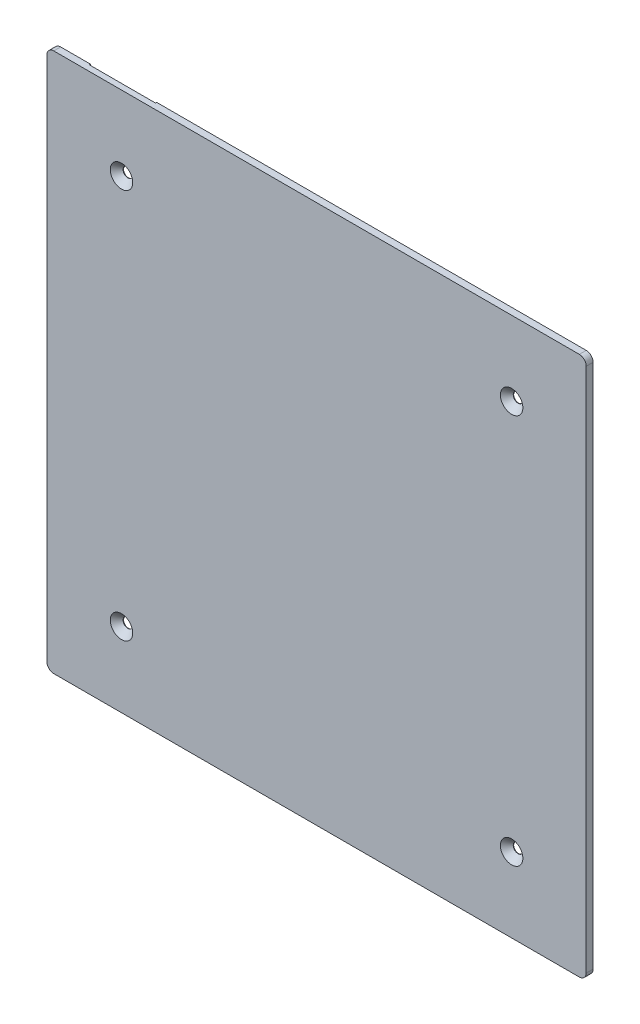
ISO-10303-21;
HEADER;
FILE_DESCRIPTION(('STEP AP214'),'2;1');
FILE_NAME('part.step','',(''),(''),'','','');
FILE_SCHEMA(('AUTOMOTIVE_DESIGN { 1 0 10303 214 1 1 1 1 }'));
ENDSEC;
DATA;
#1=APPLICATION_CONTEXT('core data for automotive mechanical design processes');
#2=APPLICATION_PROTOCOL_DEFINITION('international standard','automotive_design',2000,#1);
#3=PRODUCT_CONTEXT('',#1,'mechanical');
#4=PRODUCT('Part','Part','',(#3));
#5=PRODUCT_RELATED_PRODUCT_CATEGORY('part','',(#4));
#6=PRODUCT_DEFINITION_FORMATION('','',#4);
#7=PRODUCT_DEFINITION_CONTEXT('part definition',#1,'design');
#8=PRODUCT_DEFINITION('design','',#6,#7);
#9=PRODUCT_DEFINITION_SHAPE('','',#8);
#10=(LENGTH_UNIT() NAMED_UNIT(*) SI_UNIT(.MILLI.,.METRE.));
#11=(NAMED_UNIT(*) PLANE_ANGLE_UNIT() SI_UNIT($,.RADIAN.));
#12=(NAMED_UNIT(*) SI_UNIT($,.STERADIAN.) SOLID_ANGLE_UNIT());
#13=UNCERTAINTY_MEASURE_WITH_UNIT(LENGTH_MEASURE(1.E-05),#10,'distance_accuracy_value','');
#14=(GEOMETRIC_REPRESENTATION_CONTEXT(3) GLOBAL_UNCERTAINTY_ASSIGNED_CONTEXT((#13)) GLOBAL_UNIT_ASSIGNED_CONTEXT((#10,
#11,#12)) REPRESENTATION_CONTEXT('',''));
#15=CARTESIAN_POINT('',(0.,0.,0.));
#16=DIRECTION('',(0.,0.,1.));
#17=DIRECTION('',(1.,0.,0.));
#18=AXIS2_PLACEMENT_3D('',#15,#16,#17);
#19=CARTESIAN_POINT('',(-72.6507614869108,117.5,0.5));
#20=DIRECTION('',(1.,0.,0.));
#21=DIRECTION('',(0.,0.,-1.));
#22=AXIS2_PLACEMENT_3D('',#19,#20,#21);
#23=PLANE('',#22);
#24=DIRECTION('',(0.,0.,-1.));
#25=VECTOR('',#24,1.);
#26=CARTESIAN_POINT('',(-72.6507614869108,106.050790199477,0.5));
#27=LINE('',#26,#25);
#28=CARTESIAN_POINT('',(-72.6507614869108,106.050790199477,0.));
#29=VERTEX_POINT('',#28);
#30=CARTESIAN_POINT('',(-72.6507614869108,106.050790199477,0.5));
#31=VERTEX_POINT('',#30);
#32=EDGE_CURVE('E169',#29,#31,#27,.F.);
#33=ORIENTED_EDGE('',*,*,#32,.T.);
#34=DIRECTION('',(0.,1.,0.));
#35=VECTOR('',#34,1.);
#36=CARTESIAN_POINT('',(-72.6507614869108,0.,0.5));
#37=LINE('',#36,#35);
#38=CARTESIAN_POINT('',(-72.6507614869108,117.5,0.5));
#39=VERTEX_POINT('',#38);
#40=EDGE_CURVE('E116',#39,#31,#37,.F.);
#41=ORIENTED_EDGE('',*,*,#40,.F.);
#42=DIRECTION('',(0.,0.,-1.));
#43=VECTOR('',#42,1.);
#44=CARTESIAN_POINT('',(-72.6507614869108,117.5,0.5));
#45=LINE('',#44,#43);
#46=CARTESIAN_POINT('',(-72.6507614869108,117.5,0.));
#47=VERTEX_POINT('',#46);
#48=EDGE_CURVE('E112',#47,#39,#45,.F.);
#49=ORIENTED_EDGE('',*,*,#48,.F.);
#50=DIRECTION('',(0.,1.,0.));
#51=VECTOR('',#50,1.);
#52=CARTESIAN_POINT('',(-72.6507614869108,0.,0.));
#53=LINE('',#52,#51);
#54=EDGE_CURVE('E115',#29,#47,#53,.T.);
#55=ORIENTED_EDGE('',*,*,#54,.F.);
#56=EDGE_LOOP('',(#33,#41,#49,#55));
#57=FACE_BOUND('',#56,.T.);
#58=ADVANCED_FACE('F16',(#57),#23,.F.);
#59=CARTESIAN_POINT('',(-101.46292574176,117.5,0.5));
#60=DIRECTION('',(-1.,0.,0.));
#61=DIRECTION('',(0.,0.,1.));
#62=AXIS2_PLACEMENT_3D('',#59,#60,#61);
#63=PLANE('',#62);
#64=DIRECTION('',(0.,0.,1.));
#65=VECTOR('',#64,1.);
#66=CARTESIAN_POINT('',(-101.46292574176,117.5,0.5));
#67=LINE('',#66,#65);
#68=CARTESIAN_POINT('',(-101.46292574176,117.5,0.5));
#69=VERTEX_POINT('',#68);
#70=CARTESIAN_POINT('',(-101.46292574176,117.5,0.));
#71=VERTEX_POINT('',#70);
#72=EDGE_CURVE('E121',#69,#71,#67,.F.);
#73=ORIENTED_EDGE('',*,*,#72,.F.);
#74=DIRECTION('',(0.,1.,0.));
#75=VECTOR('',#74,1.);
#76=CARTESIAN_POINT('',(-101.46292574176,0.,0.5));
#77=LINE('',#76,#75);
#78=CARTESIAN_POINT('',(-101.46292574176,106.050790199477,0.5));
#79=VERTEX_POINT('',#78);
#80=EDGE_CURVE('E129',#79,#69,#77,.T.);
#81=ORIENTED_EDGE('',*,*,#80,.F.);
#82=DIRECTION('',(0.,0.,-1.));
#83=VECTOR('',#82,1.);
#84=CARTESIAN_POINT('',(-101.46292574176,106.050790199477,0.5));
#85=LINE('',#84,#83);
#86=CARTESIAN_POINT('',(-101.46292574176,106.050790199477,0.));
#87=VERTEX_POINT('',#86);
#88=EDGE_CURVE('E172',#79,#87,#85,.T.);
#89=ORIENTED_EDGE('',*,*,#88,.T.);
#90=DIRECTION('',(0.,1.,0.));
#91=VECTOR('',#90,1.);
#92=CARTESIAN_POINT('',(-101.46292574176,0.,0.));
#93=LINE('',#92,#91);
#94=EDGE_CURVE('E93',#71,#87,#93,.F.);
#95=ORIENTED_EDGE('',*,*,#94,.F.);
#96=EDGE_LOOP('',(#73,#81,#89,#95));
#97=FACE_BOUND('',#96,.T.);
#98=ADVANCED_FACE('F336',(#97),#63,.F.);
#99=CARTESIAN_POINT('',(-72.6507614869108,106.050790199477,0.5));
#100=DIRECTION('',(0.,-1.,0.));
#101=DIRECTION('',(0.,0.,-1.));
#102=AXIS2_PLACEMENT_3D('',#99,#100,#101);
#103=PLANE('',#102);
#104=ORIENTED_EDGE('',*,*,#88,.F.);
#105=DIRECTION('',(-1.,0.,0.));
#106=VECTOR('',#105,1.);
#107=CARTESIAN_POINT('',(0.,106.050790199477,0.5));
#108=LINE('',#107,#106);
#109=EDGE_CURVE('E184',#31,#79,#108,.T.);
#110=ORIENTED_EDGE('',*,*,#109,.F.);
#111=ORIENTED_EDGE('',*,*,#32,.F.);
#112=DIRECTION('',(-1.,0.,0.));
#113=VECTOR('',#112,1.);
#114=CARTESIAN_POINT('',(0.,106.050790199477,0.));
#115=LINE('',#114,#113);
#116=EDGE_CURVE('E128',#87,#29,#115,.F.);
#117=ORIENTED_EDGE('',*,*,#116,.F.);
#118=EDGE_LOOP('',(#104,#110,#111,#117));
#119=FACE_BOUND('',#118,.T.);
#120=ADVANCED_FACE('F249',(#119),#103,.F.);
#121=CARTESIAN_POINT('',(-85.,-85.,3.));
#122=DIRECTION('',(0.,0.,-1.));
#123=DIRECTION('',(-1.,0.,0.));
#124=AXIS2_PLACEMENT_3D('',#121,#122,#123);
#125=CYLINDRICAL_SURFACE('',#124,2.1);
#126=CARTESIAN_POINT('',(-85.,-85.,0.));
#127=DIRECTION('',(0.,0.,-1.));
#128=DIRECTION('',(-1.,0.,0.));
#129=AXIS2_PLACEMENT_3D('',#126,#127,#128);
#130=CIRCLE('',#129,2.1);
#131=CARTESIAN_POINT('',(-87.1,-85.,0.));
#132=VERTEX_POINT('',#131);
#133=EDGE_CURVE('E19',#132,#132,#130,.F.);
#134=ORIENTED_EDGE('',*,*,#133,.F.);
#135=EDGE_LOOP('',(#134));
#136=FACE_BOUND('',#135,.T.);
#137=CARTESIAN_POINT('',(-85.,-85.,0.200000000006639));
#138=DIRECTION('',(0.,0.,1.));
#139=DIRECTION('',(1.,0.,0.));
#140=AXIS2_PLACEMENT_3D('',#137,#138,#139);
#141=CIRCLE('',#140,2.09999999994806);
#142=CARTESIAN_POINT('',(-82.9000000000519,-85.,0.200000000006639));
#143=VERTEX_POINT('',#142);
#144=EDGE_CURVE('E164',#143,#143,#141,.T.);
#145=ORIENTED_EDGE('',*,*,#144,.T.);
#146=EDGE_LOOP('',(#145));
#147=FACE_BOUND('',#146,.T.);
#148=ADVANCED_FACE('F245',(#136,#147),#125,.F.);
#149=CARTESIAN_POINT('',(85.,-85.,3.));
#150=DIRECTION('',(0.,0.,-1.));
#151=DIRECTION('',(-1.,0.,0.));
#152=AXIS2_PLACEMENT_3D('',#149,#150,#151);
#153=CYLINDRICAL_SURFACE('',#152,2.1);
#154=CARTESIAN_POINT('',(85.,-85.,0.));
#155=DIRECTION('',(0.,0.,-1.));
#156=DIRECTION('',(-1.,0.,0.));
#157=AXIS2_PLACEMENT_3D('',#154,#155,#156);
#158=CIRCLE('',#157,2.1);
#159=CARTESIAN_POINT('',(82.9,-85.,0.));
#160=VERTEX_POINT('',#159);
#161=EDGE_CURVE('E167',#160,#160,#158,.F.);
#162=ORIENTED_EDGE('',*,*,#161,.F.);
#163=EDGE_LOOP('',(#162));
#164=FACE_BOUND('',#163,.T.);
#165=CARTESIAN_POINT('',(85.,-85.,0.200000000006639));
#166=DIRECTION('',(0.,0.,1.));
#167=DIRECTION('',(1.,0.,0.));
#168=AXIS2_PLACEMENT_3D('',#165,#166,#167);
#169=CIRCLE('',#168,2.09999999996396);
#170=CARTESIAN_POINT('',(87.099999999964,-85.,0.200000000006639));
#171=VERTEX_POINT('',#170);
#172=EDGE_CURVE('E161',#171,#171,#169,.T.);
#173=ORIENTED_EDGE('',*,*,#172,.T.);
#174=EDGE_LOOP('',(#173));
#175=FACE_BOUND('',#174,.T.);
#176=ADVANCED_FACE('F248',(#164,#175),#153,.F.);
#177=CARTESIAN_POINT('',(85.,85.,3.));
#178=DIRECTION('',(0.,0.,-1.));
#179=DIRECTION('',(-1.,0.,0.));
#180=AXIS2_PLACEMENT_3D('',#177,#178,#179);
#181=CYLINDRICAL_SURFACE('',#180,2.1);
#182=CARTESIAN_POINT('',(85.,85.,0.));
#183=DIRECTION('',(0.,0.,-1.));
#184=DIRECTION('',(-1.,0.,0.));
#185=AXIS2_PLACEMENT_3D('',#182,#183,#184);
#186=CIRCLE('',#185,2.1);
#187=CARTESIAN_POINT('',(82.9,85.,0.));
#188=VERTEX_POINT('',#187);
#189=EDGE_CURVE('E235',#188,#188,#186,.F.);
#190=ORIENTED_EDGE('',*,*,#189,.F.);
#191=EDGE_LOOP('',(#190));
#192=FACE_BOUND('',#191,.T.);
#193=CARTESIAN_POINT('',(85.,85.,0.200000000006639));
#194=DIRECTION('',(0.,0.,1.));
#195=DIRECTION('',(1.,0.,0.));
#196=AXIS2_PLACEMENT_3D('',#193,#194,#195);
#197=CIRCLE('',#196,2.09999999996396);
#198=CARTESIAN_POINT('',(87.099999999964,85.,0.200000000006639));
#199=VERTEX_POINT('',#198);
#200=EDGE_CURVE('E158',#199,#199,#197,.T.);
#201=ORIENTED_EDGE('',*,*,#200,.T.);
#202=EDGE_LOOP('',(#201));
#203=FACE_BOUND('',#202,.T.);
#204=ADVANCED_FACE('F319',(#192,#203),#181,.F.);
#205=CARTESIAN_POINT('',(-85.,85.,3.));
#206=DIRECTION('',(0.,0.,-1.));
#207=DIRECTION('',(-1.,0.,0.));
#208=AXIS2_PLACEMENT_3D('',#205,#206,#207);
#209=CYLINDRICAL_SURFACE('',#208,2.1);
#210=CARTESIAN_POINT('',(-85.,85.,0.));
#211=DIRECTION('',(0.,0.,-1.));
#212=DIRECTION('',(-1.,0.,0.));
#213=AXIS2_PLACEMENT_3D('',#210,#211,#212);
#214=CIRCLE('',#213,2.1);
#215=CARTESIAN_POINT('',(-87.1,85.,0.));
#216=VERTEX_POINT('',#215);
#217=EDGE_CURVE('E237',#216,#216,#214,.F.);
#218=ORIENTED_EDGE('',*,*,#217,.F.);
#219=EDGE_LOOP('',(#218));
#220=FACE_BOUND('',#219,.T.);
#221=CARTESIAN_POINT('',(-85.,85.,0.200000000006639));
#222=DIRECTION('',(0.,0.,1.));
#223=DIRECTION('',(1.,0.,0.));
#224=AXIS2_PLACEMENT_3D('',#221,#222,#223);
#225=CIRCLE('',#224,2.09999999994806);
#226=CARTESIAN_POINT('',(-82.9000000000519,85.,0.200000000006639));
#227=VERTEX_POINT('',#226);
#228=EDGE_CURVE('E155',#227,#227,#225,.T.);
#229=ORIENTED_EDGE('',*,*,#228,.T.);
#230=EDGE_LOOP('',(#229));
#231=FACE_BOUND('',#230,.T.);
#232=ADVANCED_FACE('F321',(#220,#231),#209,.F.);
#233=CARTESIAN_POINT('',(0.,0.,0.5));
#234=DIRECTION('',(0.,0.,-1.));
#235=DIRECTION('',(-1.,0.,0.));
#236=AXIS2_PLACEMENT_3D('',#233,#234,#235);
#237=PLANE('',#236);
#238=ORIENTED_EDGE('',*,*,#80,.T.);
#239=DIRECTION('',(1.,0.,0.));
#240=VECTOR('',#239,1.);
#241=CARTESIAN_POINT('',(-117.5,117.5,0.5));
#242=LINE('',#241,#240);
#243=EDGE_CURVE('E135',#69,#39,#242,.T.);
#244=ORIENTED_EDGE('',*,*,#243,.T.);
#245=ORIENTED_EDGE('',*,*,#40,.T.);
#246=ORIENTED_EDGE('',*,*,#109,.T.);
#247=EDGE_LOOP('',(#238,#244,#245,#246));
#248=FACE_BOUND('',#247,.T.);
#249=ADVANCED_FACE('F266',(#248),#237,.T.);
#250=CARTESIAN_POINT('',(0.,0.,0.));
#251=DIRECTION('',(0.,0.,-1.));
#252=DIRECTION('',(-1.,0.,0.));
#253=AXIS2_PLACEMENT_3D('',#250,#251,#252);
#254=PLANE('',#253);
#255=ORIENTED_EDGE('',*,*,#161,.T.);
#256=EDGE_LOOP('',(#255));
#257=FACE_BOUND('',#256,.T.);
#258=ORIENTED_EDGE('',*,*,#189,.T.);
#259=EDGE_LOOP('',(#258));
#260=FACE_BOUND('',#259,.T.);
#261=ORIENTED_EDGE('',*,*,#217,.T.);
#262=EDGE_LOOP('',(#261));
#263=FACE_BOUND('',#262,.T.);
#264=ORIENTED_EDGE('',*,*,#133,.T.);
#265=EDGE_LOOP('',(#264));
#266=FACE_BOUND('',#265,.T.);
#267=ORIENTED_EDGE('',*,*,#94,.T.);
#268=ORIENTED_EDGE('',*,*,#116,.T.);
#269=ORIENTED_EDGE('',*,*,#54,.T.);
#270=DIRECTION('',(1.,0.,0.));
#271=VECTOR('',#270,1.);
#272=CARTESIAN_POINT('',(-117.5,117.5,0.));
#273=LINE('',#272,#271);
#274=CARTESIAN_POINT('',(114.5,117.5,0.));
#275=VERTEX_POINT('',#274);
#276=EDGE_CURVE('E125',#47,#275,#273,.T.);
#277=ORIENTED_EDGE('',*,*,#276,.T.);
#278=CARTESIAN_POINT('',(114.5,114.5,0.));
#279=DIRECTION('',(0.,0.,-1.));
#280=DIRECTION('',(-1.,0.,0.));
#281=AXIS2_PLACEMENT_3D('',#278,#279,#280);
#282=CIRCLE('',#281,3.);
#283=CARTESIAN_POINT('',(117.5,114.5,0.));
#284=VERTEX_POINT('',#283);
#285=EDGE_CURVE('E134',#284,#275,#282,.F.);
#286=ORIENTED_EDGE('',*,*,#285,.F.);
#287=DIRECTION('',(0.,1.,0.));
#288=VECTOR('',#287,1.);
#289=CARTESIAN_POINT('',(117.5,-117.5,0.));
#290=LINE('',#289,#288);
#291=CARTESIAN_POINT('',(117.5,-114.5,0.));
#292=VERTEX_POINT('',#291);
#293=EDGE_CURVE('E142',#284,#292,#290,.F.);
#294=ORIENTED_EDGE('',*,*,#293,.T.);
#295=CARTESIAN_POINT('',(114.5,-114.5,0.));
#296=DIRECTION('',(0.,0.,-1.));
#297=DIRECTION('',(-1.,0.,0.));
#298=AXIS2_PLACEMENT_3D('',#295,#296,#297);
#299=CIRCLE('',#298,3.);
#300=CARTESIAN_POINT('',(114.5,-117.5,0.));
#301=VERTEX_POINT('',#300);
#302=EDGE_CURVE('E229',#301,#292,#299,.F.);
#303=ORIENTED_EDGE('',*,*,#302,.F.);
#304=DIRECTION('',(1.,0.,0.));
#305=VECTOR('',#304,1.);
#306=CARTESIAN_POINT('',(-117.5,-117.5,0.));
#307=LINE('',#306,#305);
#308=CARTESIAN_POINT('',(-114.5,-117.5,0.));
#309=VERTEX_POINT('',#308);
#310=EDGE_CURVE('E228',#301,#309,#307,.F.);
#311=ORIENTED_EDGE('',*,*,#310,.T.);
#312=CARTESIAN_POINT('',(-114.5,-114.5,0.));
#313=DIRECTION('',(0.,0.,-1.));
#314=DIRECTION('',(-1.,0.,0.));
#315=AXIS2_PLACEMENT_3D('',#312,#313,#314);
#316=CIRCLE('',#315,3.);
#317=CARTESIAN_POINT('',(-117.5,-114.5,0.));
#318=VERTEX_POINT('',#317);
#319=EDGE_CURVE('E225',#318,#309,#316,.F.);
#320=ORIENTED_EDGE('',*,*,#319,.F.);
#321=DIRECTION('',(0.,1.,0.));
#322=VECTOR('',#321,1.);
#323=CARTESIAN_POINT('',(-117.5,-117.5,0.));
#324=LINE('',#323,#322);
#325=CARTESIAN_POINT('',(-117.5,114.5,0.));
#326=VERTEX_POINT('',#325);
#327=EDGE_CURVE('E224',#318,#326,#324,.T.);
#328=ORIENTED_EDGE('',*,*,#327,.T.);
#329=CARTESIAN_POINT('',(-114.5,114.5,0.));
#330=DIRECTION('',(0.,0.,-1.));
#331=DIRECTION('',(-1.,0.,0.));
#332=AXIS2_PLACEMENT_3D('',#329,#330,#331);
#333=CIRCLE('',#332,3.);
#334=CARTESIAN_POINT('',(-114.5,117.5,0.));
#335=VERTEX_POINT('',#334);
#336=EDGE_CURVE('E83',#335,#326,#333,.F.);
#337=ORIENTED_EDGE('',*,*,#336,.F.);
#338=DIRECTION('',(1.,0.,0.));
#339=VECTOR('',#338,1.);
#340=CARTESIAN_POINT('',(-117.5,117.5,0.));
#341=LINE('',#340,#339);
#342=EDGE_CURVE('E138',#335,#71,#341,.T.);
#343=ORIENTED_EDGE('',*,*,#342,.T.);
#344=EDGE_LOOP('',(#267,#268,#269,#277,#286,#294,#303,#311,#320,#328,#337,#343));
#345=FACE_BOUND('',#344,.T.);
#346=ADVANCED_FACE('F124',(#257,#260,#263,#266,#345),#254,.T.);
#347=CARTESIAN_POINT('',(-85.,-85.,2.9999999999859));
#348=DIRECTION('',(0.,0.,1.));
#349=DIRECTION('',(1.,0.,0.));
#350=AXIS2_PLACEMENT_3D('',#347,#348,#349);
#351=CONICAL_SURFACE('',#350,4.89999999998417,0.785398163407599);
#352=CARTESIAN_POINT('',(-85.,-85.,3.00000000002229));
#353=DIRECTION('',(0.,0.,1.));
#354=DIRECTION('',(1.,0.,0.));
#355=AXIS2_PLACEMENT_3D('',#352,#353,#354);
#356=CIRCLE('',#355,4.90000000002055);
#357=CARTESIAN_POINT('',(-80.0999999999794,-85.,3.00000000002229));
#358=VERTEX_POINT('',#357);
#359=EDGE_CURVE('E221',#358,#358,#356,.T.);
#360=ORIENTED_EDGE('',*,*,#359,.T.);
#361=EDGE_LOOP('',(#360));
#362=FACE_BOUND('',#361,.T.);
#363=ORIENTED_EDGE('',*,*,#144,.F.);
#364=EDGE_LOOP('',(#363));
#365=FACE_BOUND('',#364,.T.);
#366=ADVANCED_FACE('F253',(#362,#365),#351,.F.);
#367=CARTESIAN_POINT('',(85.,-85.,2.99999999987222));
#368=DIRECTION('',(0.,0.,1.));
#369=DIRECTION('',(0.,-1.,0.));
#370=AXIS2_PLACEMENT_3D('',#367,#368,#369);
#371=CONICAL_SURFACE('',#370,4.89999999988638,0.785398163397448);
#372=CARTESIAN_POINT('',(85.,-85.,2.9999999999859));
#373=DIRECTION('',(0.,0.,1.));
#374=DIRECTION('',(0.,-1.,0.));
#375=AXIS2_PLACEMENT_3D('',#372,#373,#374);
#376=CIRCLE('',#375,4.90000000000007);
#377=CARTESIAN_POINT('',(85.,-89.9000000000001,2.9999999999859));
#378=VERTEX_POINT('',#377);
#379=EDGE_CURVE('E218',#378,#378,#376,.T.);
#380=ORIENTED_EDGE('',*,*,#379,.T.);
#381=EDGE_LOOP('',(#380));
#382=FACE_BOUND('',#381,.T.);
#383=ORIENTED_EDGE('',*,*,#172,.F.);
#384=EDGE_LOOP('',(#383));
#385=FACE_BOUND('',#384,.T.);
#386=ADVANCED_FACE('F255',(#382,#385),#371,.F.);
#387=CARTESIAN_POINT('',(85.,85.,2.99999999987222));
#388=DIRECTION('',(0.,0.,1.));
#389=DIRECTION('',(0.,-1.,0.));
#390=AXIS2_PLACEMENT_3D('',#387,#388,#389);
#391=CONICAL_SURFACE('',#390,4.89999999988638,0.785398163397448);
#392=CARTESIAN_POINT('',(85.,85.,2.9999999999859));
#393=DIRECTION('',(0.,0.,1.));
#394=DIRECTION('',(0.,-1.,0.));
#395=AXIS2_PLACEMENT_3D('',#392,#393,#394);
#396=CIRCLE('',#395,4.90000000000007);
#397=CARTESIAN_POINT('',(85.,80.1,2.9999999999859));
#398=VERTEX_POINT('',#397);
#399=EDGE_CURVE('E215',#398,#398,#396,.T.);
#400=ORIENTED_EDGE('',*,*,#399,.T.);
#401=EDGE_LOOP('',(#400));
#402=FACE_BOUND('',#401,.T.);
#403=ORIENTED_EDGE('',*,*,#200,.F.);
#404=EDGE_LOOP('',(#403));
#405=FACE_BOUND('',#404,.T.);
#406=ADVANCED_FACE('F263',(#402,#405),#391,.F.);
#407=CARTESIAN_POINT('',(-85.,85.,2.9999999999859));
#408=DIRECTION('',(0.,0.,1.));
#409=DIRECTION('',(1.,0.,0.));
#410=AXIS2_PLACEMENT_3D('',#407,#408,#409);
#411=CONICAL_SURFACE('',#410,4.89999999998417,0.785398163407599);
#412=CARTESIAN_POINT('',(-85.,85.,3.00000000002229));
#413=DIRECTION('',(0.,0.,1.));
#414=DIRECTION('',(1.,0.,0.));
#415=AXIS2_PLACEMENT_3D('',#412,#413,#414);
#416=CIRCLE('',#415,4.90000000002055);
#417=CARTESIAN_POINT('',(-80.0999999999794,85.,3.00000000002229));
#418=VERTEX_POINT('',#417);
#419=EDGE_CURVE('E212',#418,#418,#416,.T.);
#420=ORIENTED_EDGE('',*,*,#419,.T.);
#421=EDGE_LOOP('',(#420));
#422=FACE_BOUND('',#421,.T.);
#423=ORIENTED_EDGE('',*,*,#228,.F.);
#424=EDGE_LOOP('',(#423));
#425=FACE_BOUND('',#424,.T.);
#426=ADVANCED_FACE('F306',(#422,#425),#411,.F.);
#427=CARTESIAN_POINT('',(-114.5,114.5,3.));
#428=DIRECTION('',(0.,0.,-1.));
#429=DIRECTION('',(-1.,0.,0.));
#430=AXIS2_PLACEMENT_3D('',#427,#428,#429);
#431=CYLINDRICAL_SURFACE('',#430,3.);
#432=ORIENTED_EDGE('',*,*,#336,.T.);
#433=DIRECTION('',(0.,0.,-1.));
#434=VECTOR('',#433,1.);
#435=CARTESIAN_POINT('',(-117.5,114.5,3.));
#436=LINE('',#435,#434);
#437=CARTESIAN_POINT('',(-117.5,114.5,3.));
#438=VERTEX_POINT('',#437);
#439=EDGE_CURVE('E539',#326,#438,#436,.F.);
#440=ORIENTED_EDGE('',*,*,#439,.T.);
#441=CARTESIAN_POINT('',(-114.5,114.5,3.));
#442=DIRECTION('',(0.,0.,-1.));
#443=DIRECTION('',(-1.,0.,0.));
#444=AXIS2_PLACEMENT_3D('',#441,#442,#443);
#445=CIRCLE('',#444,3.);
#446=CARTESIAN_POINT('',(-114.5,117.5,3.));
#447=VERTEX_POINT('',#446);
#448=EDGE_CURVE('E209',#438,#447,#445,.T.);
#449=ORIENTED_EDGE('',*,*,#448,.T.);
#450=DIRECTION('',(0.,0.,-1.));
#451=VECTOR('',#450,1.);
#452=CARTESIAN_POINT('',(-114.5,117.5,3.));
#453=LINE('',#452,#451);
#454=EDGE_CURVE('E149',#447,#335,#453,.T.);
#455=ORIENTED_EDGE('',*,*,#454,.T.);
#456=EDGE_LOOP('',(#432,#440,#449,#455));
#457=FACE_BOUND('',#456,.T.);
#458=ADVANCED_FACE('F303',(#457),#431,.T.);
#459=CARTESIAN_POINT('',(-117.5,117.5,3.));
#460=DIRECTION('',(0.,-1.,0.));
#461=DIRECTION('',(0.,0.,-1.));
#462=AXIS2_PLACEMENT_3D('',#459,#460,#461);
#463=PLANE('',#462);
#464=ORIENTED_EDGE('',*,*,#48,.T.);
#465=ORIENTED_EDGE('',*,*,#243,.F.);
#466=ORIENTED_EDGE('',*,*,#72,.T.);
#467=ORIENTED_EDGE('',*,*,#342,.F.);
#468=ORIENTED_EDGE('',*,*,#454,.F.);
#469=DIRECTION('',(-1.,0.,0.));
#470=VECTOR('',#469,1.);
#471=CARTESIAN_POINT('',(0.,117.5,3.));
#472=LINE('',#471,#470);
#473=CARTESIAN_POINT('',(114.5,117.5,3.));
#474=VERTEX_POINT('',#473);
#475=EDGE_CURVE('E208',#447,#474,#472,.F.);
#476=ORIENTED_EDGE('',*,*,#475,.T.);
#477=DIRECTION('',(0.,0.,-1.));
#478=VECTOR('',#477,1.);
#479=CARTESIAN_POINT('',(114.5,117.5,3.));
#480=LINE('',#479,#478);
#481=EDGE_CURVE('E133',#275,#474,#480,.F.);
#482=ORIENTED_EDGE('',*,*,#481,.F.);
#483=ORIENTED_EDGE('',*,*,#276,.F.);
#484=EDGE_LOOP('',(#464,#465,#466,#467,#468,#476,#482,#483));
#485=FACE_BOUND('',#484,.T.);
#486=ADVANCED_FACE('F131',(#485),#463,.F.);
#487=CARTESIAN_POINT('',(114.5,114.5,3.));
#488=DIRECTION('',(0.,0.,-1.));
#489=DIRECTION('',(-1.,0.,0.));
#490=AXIS2_PLACEMENT_3D('',#487,#488,#489);
#491=CYLINDRICAL_SURFACE('',#490,3.);
#492=ORIENTED_EDGE('',*,*,#285,.T.);
#493=ORIENTED_EDGE('',*,*,#481,.T.);
#494=CARTESIAN_POINT('',(114.5,114.5,3.));
#495=DIRECTION('',(0.,0.,-1.));
#496=DIRECTION('',(-1.,0.,0.));
#497=AXIS2_PLACEMENT_3D('',#494,#495,#496);
#498=CIRCLE('',#497,3.);
#499=CARTESIAN_POINT('',(117.5,114.5,3.));
#500=VERTEX_POINT('',#499);
#501=EDGE_CURVE('E205',#474,#500,#498,.T.);
#502=ORIENTED_EDGE('',*,*,#501,.T.);
#503=DIRECTION('',(0.,0.,1.));
#504=VECTOR('',#503,1.);
#505=CARTESIAN_POINT('',(117.5,114.5,3.));
#506=LINE('',#505,#504);
#507=EDGE_CURVE('E528',#500,#284,#506,.F.);
#508=ORIENTED_EDGE('',*,*,#507,.T.);
#509=EDGE_LOOP('',(#492,#493,#502,#508));
#510=FACE_BOUND('',#509,.T.);
#511=ADVANCED_FACE('F296',(#510),#491,.T.);
#512=CARTESIAN_POINT('',(117.5,-117.5,3.));
#513=DIRECTION('',(-1.,0.,0.));
#514=DIRECTION('',(0.,0.,1.));
#515=AXIS2_PLACEMENT_3D('',#512,#513,#514);
#516=PLANE('',#515);
#517=DIRECTION('',(0.,0.,-1.));
#518=VECTOR('',#517,1.);
#519=CARTESIAN_POINT('',(117.5,-114.5,3.));
#520=LINE('',#519,#518);
#521=CARTESIAN_POINT('',(117.5,-114.5,3.));
#522=VERTEX_POINT('',#521);
#523=EDGE_CURVE('E230',#292,#522,#520,.F.);
#524=ORIENTED_EDGE('',*,*,#523,.F.);
#525=ORIENTED_EDGE('',*,*,#293,.F.);
#526=ORIENTED_EDGE('',*,*,#507,.F.);
#527=DIRECTION('',(0.,1.,0.));
#528=VECTOR('',#527,1.);
#529=CARTESIAN_POINT('',(117.5,0.,3.));
#530=LINE('',#529,#528);
#531=EDGE_CURVE('E204',#500,#522,#530,.F.);
#532=ORIENTED_EDGE('',*,*,#531,.T.);
#533=EDGE_LOOP('',(#524,#525,#526,#532));
#534=FACE_BOUND('',#533,.T.);
#535=ADVANCED_FACE('F292',(#534),#516,.F.);
#536=CARTESIAN_POINT('',(114.5,-114.5,3.));
#537=DIRECTION('',(0.,0.,-1.));
#538=DIRECTION('',(-1.,0.,0.));
#539=AXIS2_PLACEMENT_3D('',#536,#537,#538);
#540=CYLINDRICAL_SURFACE('',#539,3.);
#541=ORIENTED_EDGE('',*,*,#302,.T.);
#542=ORIENTED_EDGE('',*,*,#523,.T.);
#543=CARTESIAN_POINT('',(114.5,-114.5,3.));
#544=DIRECTION('',(0.,0.,-1.));
#545=DIRECTION('',(-1.,0.,0.));
#546=AXIS2_PLACEMENT_3D('',#543,#544,#545);
#547=CIRCLE('',#546,3.);
#548=CARTESIAN_POINT('',(114.5,-117.5,3.));
#549=VERTEX_POINT('',#548);
#550=EDGE_CURVE('E201',#522,#549,#547,.T.);
#551=ORIENTED_EDGE('',*,*,#550,.T.);
#552=DIRECTION('',(0.,0.,1.));
#553=VECTOR('',#552,1.);
#554=CARTESIAN_POINT('',(114.5,-117.5,3.));
#555=LINE('',#554,#553);
#556=EDGE_CURVE('E520',#549,#301,#555,.F.);
#557=ORIENTED_EDGE('',*,*,#556,.T.);
#558=EDGE_LOOP('',(#541,#542,#551,#557));
#559=FACE_BOUND('',#558,.T.);
#560=ADVANCED_FACE('F288',(#559),#540,.T.);
#561=CARTESIAN_POINT('',(-117.5,-117.5,3.));
#562=DIRECTION('',(0.,1.,0.));
#563=DIRECTION('',(0.,0.,1.));
#564=AXIS2_PLACEMENT_3D('',#561,#562,#563);
#565=PLANE('',#564);
#566=DIRECTION('',(0.,0.,-1.));
#567=VECTOR('',#566,1.);
#568=CARTESIAN_POINT('',(-114.5,-117.5,3.));
#569=LINE('',#568,#567);
#570=CARTESIAN_POINT('',(-114.5,-117.5,3.));
#571=VERTEX_POINT('',#570);
#572=EDGE_CURVE('E227',#309,#571,#569,.F.);
#573=ORIENTED_EDGE('',*,*,#572,.F.);
#574=ORIENTED_EDGE('',*,*,#310,.F.);
#575=ORIENTED_EDGE('',*,*,#556,.F.);
#576=DIRECTION('',(-1.,0.,0.));
#577=VECTOR('',#576,1.);
#578=CARTESIAN_POINT('',(0.,-117.5,3.));
#579=LINE('',#578,#577);
#580=EDGE_CURVE('E200',#549,#571,#579,.T.);
#581=ORIENTED_EDGE('',*,*,#580,.T.);
#582=EDGE_LOOP('',(#573,#574,#575,#581));
#583=FACE_BOUND('',#582,.T.);
#584=ADVANCED_FACE('F284',(#583),#565,.F.);
#585=CARTESIAN_POINT('',(-114.5,-114.5,3.));
#586=DIRECTION('',(0.,0.,-1.));
#587=DIRECTION('',(-1.,0.,0.));
#588=AXIS2_PLACEMENT_3D('',#585,#586,#587);
#589=CYLINDRICAL_SURFACE('',#588,3.);
#590=ORIENTED_EDGE('',*,*,#319,.T.);
#591=ORIENTED_EDGE('',*,*,#572,.T.);
#592=CARTESIAN_POINT('',(-114.5,-114.5,3.));
#593=DIRECTION('',(0.,0.,-1.));
#594=DIRECTION('',(-1.,0.,0.));
#595=AXIS2_PLACEMENT_3D('',#592,#593,#594);
#596=CIRCLE('',#595,3.);
#597=CARTESIAN_POINT('',(-117.5,-114.5,3.));
#598=VERTEX_POINT('',#597);
#599=EDGE_CURVE('E25',#571,#598,#596,.T.);
#600=ORIENTED_EDGE('',*,*,#599,.T.);
#601=DIRECTION('',(0.,0.,-1.));
#602=VECTOR('',#601,1.);
#603=CARTESIAN_POINT('',(-117.5,-114.5,3.));
#604=LINE('',#603,#602);
#605=EDGE_CURVE('E33',#598,#318,#604,.T.);
#606=ORIENTED_EDGE('',*,*,#605,.T.);
#607=EDGE_LOOP('',(#590,#591,#600,#606));
#608=FACE_BOUND('',#607,.T.);
#609=ADVANCED_FACE('F277',(#608),#589,.T.);
#610=CARTESIAN_POINT('',(-117.5,-117.5,3.));
#611=DIRECTION('',(1.,0.,0.));
#612=DIRECTION('',(0.,0.,-1.));
#613=AXIS2_PLACEMENT_3D('',#610,#611,#612);
#614=PLANE('',#613);
#615=ORIENTED_EDGE('',*,*,#605,.F.);
#616=DIRECTION('',(0.,1.,0.));
#617=VECTOR('',#616,1.);
#618=CARTESIAN_POINT('',(-117.5,0.,3.));
#619=LINE('',#618,#617);
#620=EDGE_CURVE('E11',#598,#438,#619,.T.);
#621=ORIENTED_EDGE('',*,*,#620,.T.);
#622=ORIENTED_EDGE('',*,*,#439,.F.);
#623=ORIENTED_EDGE('',*,*,#327,.F.);
#624=EDGE_LOOP('',(#615,#621,#622,#623));
#625=FACE_BOUND('',#624,.T.);
#626=ADVANCED_FACE('F271',(#625),#614,.F.);
#627=CARTESIAN_POINT('',(0.,0.,3.));
#628=DIRECTION('',(0.,0.,-1.));
#629=DIRECTION('',(-1.,0.,0.));
#630=AXIS2_PLACEMENT_3D('',#627,#628,#629);
#631=PLANE('',#630);
#632=ORIENTED_EDGE('',*,*,#599,.F.);
#633=ORIENTED_EDGE('',*,*,#580,.F.);
#634=ORIENTED_EDGE('',*,*,#550,.F.);
#635=ORIENTED_EDGE('',*,*,#531,.F.);
#636=ORIENTED_EDGE('',*,*,#501,.F.);
#637=ORIENTED_EDGE('',*,*,#475,.F.);
#638=ORIENTED_EDGE('',*,*,#448,.F.);
#639=ORIENTED_EDGE('',*,*,#620,.F.);
#640=EDGE_LOOP('',(#632,#633,#634,#635,#636,#637,#638,#639));
#641=FACE_BOUND('',#640,.T.);
#642=ORIENTED_EDGE('',*,*,#419,.F.);
#643=EDGE_LOOP('',(#642));
#644=FACE_BOUND('',#643,.T.);
#645=ORIENTED_EDGE('',*,*,#399,.F.);
#646=EDGE_LOOP('',(#645));
#647=FACE_BOUND('',#646,.T.);
#648=ORIENTED_EDGE('',*,*,#379,.F.);
#649=EDGE_LOOP('',(#648));
#650=FACE_BOUND('',#649,.T.);
#651=ORIENTED_EDGE('',*,*,#359,.F.);
#652=EDGE_LOOP('',(#651));
#653=FACE_BOUND('',#652,.T.);
#654=ADVANCED_FACE('F269',(#641,#644,#647,#650,#653),#631,.F.);
#655=CLOSED_SHELL('',(#58,#98,#120,#148,#176,#204,#232,#249,#346,#366,#386,#406,#426,#458,#486,
#511,#535,#560,#584,#609,#626,#654));
#656=MANIFOLD_SOLID_BREP('B1',#655);
#657=ADVANCED_BREP_SHAPE_REPRESENTATION('',(#18,#656),#14);
#658=SHAPE_DEFINITION_REPRESENTATION(#9,#657);
ENDSEC;
END-ISO-10303-21;
